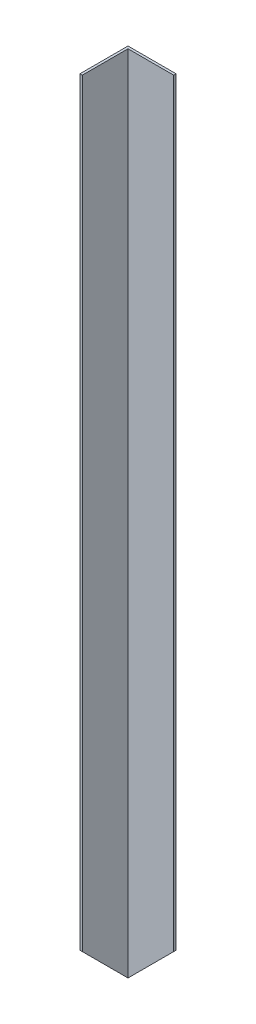
ISO-10303-21;
HEADER;
FILE_DESCRIPTION(('STEP AP214'),'2;1');
FILE_NAME('part.step','',(''),(''),'','','');
FILE_SCHEMA(('AUTOMOTIVE_DESIGN { 1 0 10303 214 1 1 1 1 }'));
ENDSEC;
DATA;
#1=APPLICATION_CONTEXT('core data for automotive mechanical design processes');
#2=APPLICATION_PROTOCOL_DEFINITION('international standard','automotive_design',2000,#1);
#3=PRODUCT_CONTEXT('',#1,'mechanical');
#4=PRODUCT('Part','Part','',(#3));
#5=PRODUCT_RELATED_PRODUCT_CATEGORY('part','',(#4));
#6=PRODUCT_DEFINITION_FORMATION('','',#4);
#7=PRODUCT_DEFINITION_CONTEXT('part definition',#1,'design');
#8=PRODUCT_DEFINITION('design','',#6,#7);
#9=PRODUCT_DEFINITION_SHAPE('','',#8);
#10=(LENGTH_UNIT() NAMED_UNIT(*) SI_UNIT(.MILLI.,.METRE.));
#11=(NAMED_UNIT(*) PLANE_ANGLE_UNIT() SI_UNIT($,.RADIAN.));
#12=(NAMED_UNIT(*) SI_UNIT($,.STERADIAN.) SOLID_ANGLE_UNIT());
#13=UNCERTAINTY_MEASURE_WITH_UNIT(LENGTH_MEASURE(1.E-05),#10,'distance_accuracy_value','');
#14=(GEOMETRIC_REPRESENTATION_CONTEXT(3) GLOBAL_UNCERTAINTY_ASSIGNED_CONTEXT((#13)) GLOBAL_UNIT_ASSIGNED_CONTEXT((#10,
#11,#12)) REPRESENTATION_CONTEXT('',''));
#15=CARTESIAN_POINT('',(0.,0.,0.));
#16=DIRECTION('',(0.,0.,1.));
#17=DIRECTION('',(1.,0.,0.));
#18=AXIS2_PLACEMENT_3D('',#15,#16,#17);
#19=CARTESIAN_POINT('',(-20.,672.,-20.1136363636364));
#20=DIRECTION('',(1.,0.,0.));
#21=DIRECTION('',(0.,0.,-1.));
#22=AXIS2_PLACEMENT_3D('',#19,#20,#21);
#23=PLANE('',#22);
#24=DIRECTION('',(0.,-1.,0.));
#25=VECTOR('',#24,1.);
#26=CARTESIAN_POINT('',(-20.,672.,-20.1136363636364));
#27=LINE('',#26,#25);
#28=CARTESIAN_POINT('',(-20.,672.,-20.1136363636364));
#29=VERTEX_POINT('',#28);
#30=CARTESIAN_POINT('',(-20.,0.,-20.1136363636364));
#31=VERTEX_POINT('',#30);
#32=EDGE_CURVE('E99',#29,#31,#27,.T.);
#33=ORIENTED_EDGE('',*,*,#32,.T.);
#34=DIRECTION('',(0.,-0.707106781186544,-0.707106781186551));
#35=VECTOR('',#34,1.);
#36=CARTESIAN_POINT('',(-20.,0.,-20.1136363636364));
#37=LINE('',#36,#35);
#38=CARTESIAN_POINT('',(-20.,39.9999999999996,19.8863636363636));
#39=VERTEX_POINT('',#38);
#40=EDGE_CURVE('E87',#39,#31,#37,.T.);
#41=ORIENTED_EDGE('',*,*,#40,.F.);
#42=DIRECTION('',(0.,-1.,0.));
#43=VECTOR('',#42,1.);
#44=CARTESIAN_POINT('',(-20.,672.,19.8863636363636));
#45=LINE('',#44,#43);
#46=CARTESIAN_POINT('',(-20.,672.,19.8863636363636));
#47=VERTEX_POINT('',#46);
#48=EDGE_CURVE('E40',#47,#39,#45,.T.);
#49=ORIENTED_EDGE('',*,*,#48,.F.);
#50=DIRECTION('',(0.,0.,1.));
#51=VECTOR('',#50,1.);
#52=CARTESIAN_POINT('',(-20.,672.,-20.1136363636364));
#53=LINE('',#52,#51);
#54=EDGE_CURVE('E123',#29,#47,#53,.T.);
#55=ORIENTED_EDGE('',*,*,#54,.F.);
#56=EDGE_LOOP('',(#33,#41,#49,#55));
#57=FACE_BOUND('',#56,.T.);
#58=ADVANCED_FACE('F33',(#57),#23,.F.);
#59=CARTESIAN_POINT('',(-20.,672.,19.8863636363636));
#60=DIRECTION('',(0.,0.,-1.));
#61=DIRECTION('',(-1.,0.,0.));
#62=AXIS2_PLACEMENT_3D('',#59,#60,#61);
#63=PLANE('',#62);
#64=ORIENTED_EDGE('',*,*,#48,.T.);
#65=DIRECTION('',(-1.,0.,0.));
#66=VECTOR('',#65,1.);
#67=CARTESIAN_POINT('',(570.,39.9999999999996,19.8863636363635));
#68=LINE('',#67,#66);
#69=CARTESIAN_POINT('',(-18.,39.9999999999996,19.8863636363636));
#70=VERTEX_POINT('',#69);
#71=EDGE_CURVE('E84',#70,#39,#68,.T.);
#72=ORIENTED_EDGE('',*,*,#71,.F.);
#73=DIRECTION('',(0.,-1.,0.));
#74=VECTOR('',#73,1.);
#75=CARTESIAN_POINT('',(-18.,672.,19.8863636363636));
#76=LINE('',#75,#74);
#77=CARTESIAN_POINT('',(-18.,672.,19.8863636363636));
#78=VERTEX_POINT('',#77);
#79=EDGE_CURVE('E103',#78,#70,#76,.T.);
#80=ORIENTED_EDGE('',*,*,#79,.F.);
#81=DIRECTION('',(1.,0.,0.));
#82=VECTOR('',#81,1.);
#83=CARTESIAN_POINT('',(-20.,672.,19.8863636363636));
#84=LINE('',#83,#82);
#85=EDGE_CURVE('E102',#47,#78,#84,.T.);
#86=ORIENTED_EDGE('',*,*,#85,.F.);
#87=EDGE_LOOP('',(#64,#72,#80,#86));
#88=FACE_BOUND('',#87,.T.);
#89=ADVANCED_FACE('F101',(#88),#63,.F.);
#90=CARTESIAN_POINT('',(-18.,672.,-18.1136363636364));
#91=DIRECTION('',(-1.,0.,0.));
#92=DIRECTION('',(0.,0.,1.));
#93=AXIS2_PLACEMENT_3D('',#90,#91,#92);
#94=PLANE('',#93);
#95=ORIENTED_EDGE('',*,*,#79,.T.);
#96=DIRECTION('',(0.,-0.707106781186544,-0.707106781186551));
#97=VECTOR('',#96,1.);
#98=CARTESIAN_POINT('',(-18.,336.999999999997,316.886363636364));
#99=LINE('',#98,#97);
#100=CARTESIAN_POINT('',(-18.,2.,-18.1136363636364));
#101=VERTEX_POINT('',#100);
#102=EDGE_CURVE('E89',#70,#101,#99,.T.);
#103=ORIENTED_EDGE('',*,*,#102,.T.);
#104=DIRECTION('',(0.,-1.,0.));
#105=VECTOR('',#104,1.);
#106=CARTESIAN_POINT('',(-18.,672.,-18.1136363636364));
#107=LINE('',#106,#105);
#108=CARTESIAN_POINT('',(-18.,672.,-18.1136363636364));
#109=VERTEX_POINT('',#108);
#110=EDGE_CURVE('E104',#109,#101,#107,.T.);
#111=ORIENTED_EDGE('',*,*,#110,.F.);
#112=DIRECTION('',(0.,0.,-1.));
#113=VECTOR('',#112,1.);
#114=CARTESIAN_POINT('',(-18.,672.,-18.1136363636364));
#115=LINE('',#114,#113);
#116=EDGE_CURVE('E120',#78,#109,#115,.T.);
#117=ORIENTED_EDGE('',*,*,#116,.F.);
#118=EDGE_LOOP('',(#95,#103,#111,#117));
#119=FACE_BOUND('',#118,.T.);
#120=ADVANCED_FACE('F136',(#119),#94,.F.);
#121=CARTESIAN_POINT('',(-18.,672.,-18.1136363636364));
#122=DIRECTION('',(0.,0.,-1.));
#123=DIRECTION('',(-1.,0.,0.));
#124=AXIS2_PLACEMENT_3D('',#121,#122,#123);
#125=PLANE('',#124);
#126=ORIENTED_EDGE('',*,*,#110,.T.);
#127=DIRECTION('',(0.707106781186547,0.707106781186549,0.));
#128=VECTOR('',#127,1.);
#129=CARTESIAN_POINT('',(317.,337.000000000001,-18.1136363636364));
#130=LINE('',#129,#128);
#131=CARTESIAN_POINT('',(20.,40.0000000000001,-18.1136363636364));
#132=VERTEX_POINT('',#131);
#133=EDGE_CURVE('E125',#101,#132,#130,.T.);
#134=ORIENTED_EDGE('',*,*,#133,.T.);
#135=DIRECTION('',(0.,-1.,0.));
#136=VECTOR('',#135,1.);
#137=CARTESIAN_POINT('',(20.,672.,-18.1136363636364));
#138=LINE('',#137,#136);
#139=CARTESIAN_POINT('',(20.,672.,-18.1136363636364));
#140=VERTEX_POINT('',#139);
#141=EDGE_CURVE('E109',#140,#132,#138,.T.);
#142=ORIENTED_EDGE('',*,*,#141,.F.);
#143=DIRECTION('',(1.,0.,0.));
#144=VECTOR('',#143,1.);
#145=CARTESIAN_POINT('',(-18.,672.,-18.1136363636364));
#146=LINE('',#145,#144);
#147=EDGE_CURVE('E118',#109,#140,#146,.T.);
#148=ORIENTED_EDGE('',*,*,#147,.F.);
#149=EDGE_LOOP('',(#126,#134,#142,#148));
#150=FACE_BOUND('',#149,.T.);
#151=ADVANCED_FACE('F144',(#150),#125,.F.);
#152=CARTESIAN_POINT('',(20.,672.,-20.1136363636364));
#153=DIRECTION('',(-1.,0.,0.));
#154=DIRECTION('',(0.,0.,1.));
#155=AXIS2_PLACEMENT_3D('',#152,#153,#154);
#156=PLANE('',#155);
#157=ORIENTED_EDGE('',*,*,#141,.T.);
#158=DIRECTION('',(0.,0.,-1.));
#159=VECTOR('',#158,1.);
#160=CARTESIAN_POINT('',(20.,40.0000000000001,569.886363636364));
#161=LINE('',#160,#159);
#162=CARTESIAN_POINT('',(20.,40.0000000000001,-20.1136363636364));
#163=VERTEX_POINT('',#162);
#164=EDGE_CURVE('E128',#132,#163,#161,.T.);
#165=ORIENTED_EDGE('',*,*,#164,.T.);
#166=DIRECTION('',(0.,-1.,0.));
#167=VECTOR('',#166,1.);
#168=CARTESIAN_POINT('',(20.,672.,-20.1136363636364));
#169=LINE('',#168,#167);
#170=CARTESIAN_POINT('',(20.,672.,-20.1136363636364));
#171=VERTEX_POINT('',#170);
#172=EDGE_CURVE('E112',#171,#163,#169,.T.);
#173=ORIENTED_EDGE('',*,*,#172,.F.);
#174=DIRECTION('',(0.,0.,-1.));
#175=VECTOR('',#174,1.);
#176=CARTESIAN_POINT('',(20.,672.,-20.1136363636364));
#177=LINE('',#176,#175);
#178=EDGE_CURVE('E52',#140,#171,#177,.T.);
#179=ORIENTED_EDGE('',*,*,#178,.F.);
#180=EDGE_LOOP('',(#157,#165,#173,#179));
#181=FACE_BOUND('',#180,.T.);
#182=ADVANCED_FACE('F154',(#181),#156,.F.);
#183=CARTESIAN_POINT('',(-20.,672.,-20.1136363636364));
#184=DIRECTION('',(0.,0.,1.));
#185=DIRECTION('',(1.,0.,0.));
#186=AXIS2_PLACEMENT_3D('',#183,#184,#185);
#187=PLANE('',#186);
#188=ORIENTED_EDGE('',*,*,#172,.T.);
#189=DIRECTION('',(0.707106781186546,0.707106781186548,0.));
#190=VECTOR('',#189,1.);
#191=CARTESIAN_POINT('',(-20.,0.,-20.1136363636364));
#192=LINE('',#191,#190);
#193=EDGE_CURVE('E131',#31,#163,#192,.T.);
#194=ORIENTED_EDGE('',*,*,#193,.F.);
#195=ORIENTED_EDGE('',*,*,#32,.F.);
#196=DIRECTION('',(-1.,0.,0.));
#197=VECTOR('',#196,1.);
#198=CARTESIAN_POINT('',(-20.,672.,-20.1136363636364));
#199=LINE('',#198,#197);
#200=EDGE_CURVE('E47',#171,#29,#199,.T.);
#201=ORIENTED_EDGE('',*,*,#200,.F.);
#202=EDGE_LOOP('',(#188,#194,#195,#201));
#203=FACE_BOUND('',#202,.T.);
#204=ADVANCED_FACE('F147',(#203),#187,.F.);
#205=CARTESIAN_POINT('',(0.,672.,0.));
#206=DIRECTION('',(0.,1.,0.));
#207=DIRECTION('',(0.,0.,1.));
#208=AXIS2_PLACEMENT_3D('',#205,#206,#207);
#209=PLANE('',#208);
#210=ORIENTED_EDGE('',*,*,#54,.T.);
#211=ORIENTED_EDGE('',*,*,#85,.T.);
#212=ORIENTED_EDGE('',*,*,#116,.T.);
#213=ORIENTED_EDGE('',*,*,#147,.T.);
#214=ORIENTED_EDGE('',*,*,#178,.T.);
#215=ORIENTED_EDGE('',*,*,#200,.T.);
#216=EDGE_LOOP('',(#210,#211,#212,#213,#214,#215));
#217=FACE_BOUND('',#216,.T.);
#218=ADVANCED_FACE('F145',(#217),#209,.T.);
#219=CARTESIAN_POINT('',(-20.,0.,569.886363636364));
#220=DIRECTION('',(-0.707106781186549,0.707106781186547,0.));
#221=DIRECTION('',(-0.707106781186547,-0.707106781186549,0.));
#222=AXIS2_PLACEMENT_3D('',#219,#220,#221);
#223=PLANE('',#222);
#224=ORIENTED_EDGE('',*,*,#133,.F.);
#225=DIRECTION('',(-0.577350269189623,-0.577350269189624,-0.57735026918963));
#226=VECTOR('',#225,1.);
#227=CARTESIAN_POINT('',(176.666666666667,196.666666666668,176.553030303033));
#228=LINE('',#227,#226);
#229=EDGE_CURVE('E11',#101,#31,#228,.T.);
#230=ORIENTED_EDGE('',*,*,#229,.T.);
#231=ORIENTED_EDGE('',*,*,#193,.T.);
#232=ORIENTED_EDGE('',*,*,#164,.F.);
#233=EDGE_LOOP('',(#224,#230,#231,#232));
#234=FACE_BOUND('',#233,.T.);
#235=ADVANCED_FACE('F140',(#234),#223,.F.);
#236=CARTESIAN_POINT('',(570.,0.,-20.1136363636365));
#237=DIRECTION('',(0.,0.707106781186551,-0.707106781186544));
#238=DIRECTION('',(0.,0.707106781186544,0.707106781186551));
#239=AXIS2_PLACEMENT_3D('',#236,#237,#238);
#240=PLANE('',#239);
#241=ORIENTED_EDGE('',*,*,#71,.T.);
#242=ORIENTED_EDGE('',*,*,#40,.T.);
#243=ORIENTED_EDGE('',*,*,#229,.F.);
#244=ORIENTED_EDGE('',*,*,#102,.F.);
#245=EDGE_LOOP('',(#241,#242,#243,#244));
#246=FACE_BOUND('',#245,.T.);
#247=ADVANCED_FACE('F86',(#246),#240,.F.);
#248=CLOSED_SHELL('',(#58,#89,#120,#151,#182,#204,#218,#235,#247));
#249=MANIFOLD_SOLID_BREP('B2',#248);
#250=ADVANCED_BREP_SHAPE_REPRESENTATION('',(#18,#249),#14);
#251=SHAPE_DEFINITION_REPRESENTATION(#9,#250);
ENDSEC;
END-ISO-10303-21;
